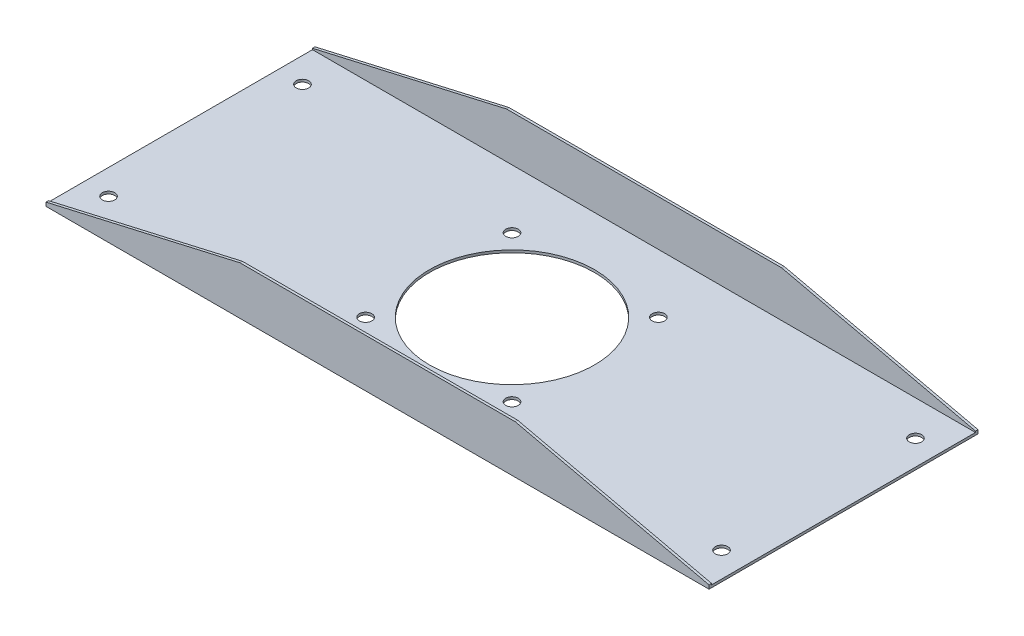
ISO-10303-21;
HEADER;
FILE_DESCRIPTION(('STEP AP214'),'2;1');
FILE_NAME('part.step','',(''),(''),'','','');
FILE_SCHEMA(('AUTOMOTIVE_DESIGN { 1 0 10303 214 1 1 1 1 }'));
ENDSEC;
DATA;
#1=APPLICATION_CONTEXT('core data for automotive mechanical design processes');
#2=APPLICATION_PROTOCOL_DEFINITION('international standard','automotive_design',2000,#1);
#3=PRODUCT_CONTEXT('',#1,'mechanical');
#4=PRODUCT('Part','Part','',(#3));
#5=PRODUCT_RELATED_PRODUCT_CATEGORY('part','',(#4));
#6=PRODUCT_DEFINITION_FORMATION('','',#4);
#7=PRODUCT_DEFINITION_CONTEXT('part definition',#1,'design');
#8=PRODUCT_DEFINITION('design','',#6,#7);
#9=PRODUCT_DEFINITION_SHAPE('','',#8);
#10=(LENGTH_UNIT() NAMED_UNIT(*) SI_UNIT(.MILLI.,.METRE.));
#11=(NAMED_UNIT(*) PLANE_ANGLE_UNIT() SI_UNIT($,.RADIAN.));
#12=(NAMED_UNIT(*) SI_UNIT($,.STERADIAN.) SOLID_ANGLE_UNIT());
#13=UNCERTAINTY_MEASURE_WITH_UNIT(LENGTH_MEASURE(1.E-05),#10,'distance_accuracy_value','');
#14=(GEOMETRIC_REPRESENTATION_CONTEXT(3) GLOBAL_UNCERTAINTY_ASSIGNED_CONTEXT((#13)) GLOBAL_UNIT_ASSIGNED_CONTEXT((#10,
#11,#12)) REPRESENTATION_CONTEXT('',''));
#15=CARTESIAN_POINT('',(0.,0.,0.));
#16=DIRECTION('',(0.,0.,1.));
#17=DIRECTION('',(1.,0.,0.));
#18=AXIS2_PLACEMENT_3D('',#15,#16,#17);
#19=CARTESIAN_POINT('',(530.,0.,103.));
#20=DIRECTION('',(0.,0.,1.));
#21=DIRECTION('',(1.,0.,0.));
#22=AXIS2_PLACEMENT_3D('',#19,#20,#21);
#23=PLANE('',#22);
#24=DIRECTION('',(-0.974760837002834,0.223251675571617,0.));
#25=VECTOR('',#24,1.);
#26=CARTESIAN_POINT('',(530.652850970427,2.85047606806343,103.));
#27=LINE('',#26,#25);
#28=CARTESIAN_POINT('',(530.,3.00000000000004,103.));
#29=VERTEX_POINT('',#28);
#30=CARTESIAN_POINT('',(375.,38.5,103.));
#31=VERTEX_POINT('',#30);
#32=EDGE_CURVE('E222',#29,#31,#27,.T.);
#33=ORIENTED_EDGE('',*,*,#32,.F.);
#34=DIRECTION('',(0.,1.,0.));
#35=VECTOR('',#34,1.);
#36=CARTESIAN_POINT('',(530.,0.,103.));
#37=LINE('',#36,#35);
#38=CARTESIAN_POINT('',(530.,2.,103.));
#39=VERTEX_POINT('',#38);
#40=EDGE_CURVE('E184',#39,#29,#37,.T.);
#41=ORIENTED_EDGE('',*,*,#40,.F.);
#42=DIRECTION('',(-1.,0.,0.));
#43=VECTOR('',#42,1.);
#44=CARTESIAN_POINT('',(530.,2.,103.));
#45=LINE('',#44,#43);
#46=CARTESIAN_POINT('',(0.,2.,103.));
#47=VERTEX_POINT('',#46);
#48=EDGE_CURVE('E185',#39,#47,#45,.T.);
#49=ORIENTED_EDGE('',*,*,#48,.T.);
#50=DIRECTION('',(0.,1.,0.));
#51=VECTOR('',#50,1.);
#52=CARTESIAN_POINT('',(0.,0.,103.));
#53=LINE('',#52,#51);
#54=CARTESIAN_POINT('',(0.,3.00000000000003,103.));
#55=VERTEX_POINT('',#54);
#56=EDGE_CURVE('E220',#47,#55,#53,.T.);
#57=ORIENTED_EDGE('',*,*,#56,.T.);
#58=DIRECTION('',(-0.974760837002834,-0.223251675571617,0.));
#59=VECTOR('',#58,1.);
#60=CARTESIAN_POINT('',(502.931254387439,118.187480843575,103.));
#61=LINE('',#60,#59);
#62=CARTESIAN_POINT('',(155.,38.5,103.));
#63=VERTEX_POINT('',#62);
#64=EDGE_CURVE('E257',#63,#55,#61,.T.);
#65=ORIENTED_EDGE('',*,*,#64,.F.);
#66=DIRECTION('',(-1.,0.,0.));
#67=VECTOR('',#66,1.);
#68=CARTESIAN_POINT('',(530.,38.5,103.));
#69=LINE('',#68,#67);
#70=EDGE_CURVE('E143',#31,#63,#69,.T.);
#71=ORIENTED_EDGE('',*,*,#70,.F.);
#72=EDGE_LOOP('',(#33,#41,#49,#57,#65,#71));
#73=FACE_BOUND('',#72,.T.);
#74=ADVANCED_FACE('F37',(#73),#23,.F.);
#75=CARTESIAN_POINT('',(530.,38.5,105.));
#76=DIRECTION('',(0.,1.,0.));
#77=DIRECTION('',(0.,0.,1.));
#78=AXIS2_PLACEMENT_3D('',#75,#76,#77);
#79=PLANE('',#78);
#80=DIRECTION('',(-1.,0.,0.));
#81=VECTOR('',#80,1.);
#82=CARTESIAN_POINT('',(530.,38.5,105.));
#83=LINE('',#82,#81);
#84=CARTESIAN_POINT('',(375.,38.5,105.));
#85=VERTEX_POINT('',#84);
#86=CARTESIAN_POINT('',(155.,38.5,105.));
#87=VERTEX_POINT('',#86);
#88=EDGE_CURVE('E141',#85,#87,#83,.T.);
#89=ORIENTED_EDGE('',*,*,#88,.F.);
#90=DIRECTION('',(0.,0.,-1.));
#91=VECTOR('',#90,1.);
#92=CARTESIAN_POINT('',(375.,38.5,105.));
#93=LINE('',#92,#91);
#94=EDGE_CURVE('E262',#85,#31,#93,.T.);
#95=ORIENTED_EDGE('',*,*,#94,.T.);
#96=ORIENTED_EDGE('',*,*,#70,.T.);
#97=DIRECTION('',(0.,0.,-1.));
#98=VECTOR('',#97,1.);
#99=CARTESIAN_POINT('',(155.,38.5,105.));
#100=LINE('',#99,#98);
#101=EDGE_CURVE('E126',#87,#63,#100,.T.);
#102=ORIENTED_EDGE('',*,*,#101,.F.);
#103=EDGE_LOOP('',(#89,#95,#96,#102));
#104=FACE_BOUND('',#103,.T.);
#105=ADVANCED_FACE('F139',(#104),#79,.T.);
#106=CARTESIAN_POINT('',(530.,0.,105.));
#107=DIRECTION('',(0.,0.,1.));
#108=DIRECTION('',(1.,0.,0.));
#109=AXIS2_PLACEMENT_3D('',#106,#107,#108);
#110=PLANE('',#109);
#111=DIRECTION('',(0.,1.,0.));
#112=VECTOR('',#111,1.);
#113=CARTESIAN_POINT('',(530.,0.,105.));
#114=LINE('',#113,#112);
#115=CARTESIAN_POINT('',(530.,0.,105.));
#116=VERTEX_POINT('',#115);
#117=CARTESIAN_POINT('',(530.,3.00000000000004,105.));
#118=VERTEX_POINT('',#117);
#119=EDGE_CURVE('E215',#116,#118,#114,.T.);
#120=ORIENTED_EDGE('',*,*,#119,.T.);
#121=DIRECTION('',(0.974760837002834,-0.223251675571617,0.));
#122=VECTOR('',#121,1.);
#123=CARTESIAN_POINT('',(530.,3.00000000000004,105.));
#124=LINE('',#123,#122);
#125=EDGE_CURVE('E58',#85,#118,#124,.T.);
#126=ORIENTED_EDGE('',*,*,#125,.F.);
#127=ORIENTED_EDGE('',*,*,#88,.T.);
#128=DIRECTION('',(0.974760837002834,0.223251675571617,0.));
#129=VECTOR('',#128,1.);
#130=CARTESIAN_POINT('',(155.,38.5,105.));
#131=LINE('',#130,#129);
#132=CARTESIAN_POINT('',(0.,3.00000000000004,105.));
#133=VERTEX_POINT('',#132);
#134=EDGE_CURVE('E123',#133,#87,#131,.T.);
#135=ORIENTED_EDGE('',*,*,#134,.F.);
#136=DIRECTION('',(0.,1.,0.));
#137=VECTOR('',#136,1.);
#138=CARTESIAN_POINT('',(0.,0.,105.));
#139=LINE('',#138,#137);
#140=CARTESIAN_POINT('',(0.,0.,105.));
#141=VERTEX_POINT('',#140);
#142=EDGE_CURVE('E179',#141,#133,#139,.T.);
#143=ORIENTED_EDGE('',*,*,#142,.F.);
#144=DIRECTION('',(-1.,0.,0.));
#145=VECTOR('',#144,1.);
#146=CARTESIAN_POINT('',(530.,0.,105.));
#147=LINE('',#146,#145);
#148=EDGE_CURVE('E149',#116,#141,#147,.T.);
#149=ORIENTED_EDGE('',*,*,#148,.F.);
#150=EDGE_LOOP('',(#120,#126,#127,#135,#143,#149));
#151=FACE_BOUND('',#150,.T.);
#152=ADVANCED_FACE('F148',(#151),#110,.T.);
#153=CARTESIAN_POINT('',(530.,0.,-110.));
#154=DIRECTION('',(0.,0.,-1.));
#155=DIRECTION('',(0.,1.,0.));
#156=AXIS2_PLACEMENT_3D('',#153,#154,#155);
#157=PLANE('',#156);
#158=DIRECTION('',(-1.,0.,0.));
#159=VECTOR('',#158,1.);
#160=CARTESIAN_POINT('',(530.,38.5,-110.));
#161=LINE('',#160,#159);
#162=CARTESIAN_POINT('',(375.,38.5,-110.));
#163=VERTEX_POINT('',#162);
#164=CARTESIAN_POINT('',(155.,38.5,-110.));
#165=VERTEX_POINT('',#164);
#166=EDGE_CURVE('E195',#163,#165,#161,.T.);
#167=ORIENTED_EDGE('',*,*,#166,.F.);
#168=DIRECTION('',(0.974760837002834,-0.223251675571617,0.));
#169=VECTOR('',#168,1.);
#170=CARTESIAN_POINT('',(530.,3.00000000000004,-110.));
#171=LINE('',#170,#169);
#172=CARTESIAN_POINT('',(530.,3.00000000000004,-110.));
#173=VERTEX_POINT('',#172);
#174=EDGE_CURVE('E134',#163,#173,#171,.T.);
#175=ORIENTED_EDGE('',*,*,#174,.T.);
#176=DIRECTION('',(0.,-1.,0.));
#177=VECTOR('',#176,1.);
#178=CARTESIAN_POINT('',(530.,0.,-110.));
#179=LINE('',#178,#177);
#180=CARTESIAN_POINT('',(530.,0.,-110.));
#181=VERTEX_POINT('',#180);
#182=EDGE_CURVE('E203',#173,#181,#179,.T.);
#183=ORIENTED_EDGE('',*,*,#182,.T.);
#184=DIRECTION('',(-1.,0.,0.));
#185=VECTOR('',#184,1.);
#186=CARTESIAN_POINT('',(530.,0.,-110.));
#187=LINE('',#186,#185);
#188=CARTESIAN_POINT('',(0.,0.,-110.));
#189=VERTEX_POINT('',#188);
#190=EDGE_CURVE('E152',#181,#189,#187,.T.);
#191=ORIENTED_EDGE('',*,*,#190,.T.);
#192=DIRECTION('',(0.,-1.,0.));
#193=VECTOR('',#192,1.);
#194=CARTESIAN_POINT('',(0.,0.,-110.));
#195=LINE('',#194,#193);
#196=CARTESIAN_POINT('',(0.,3.00000000000003,-110.));
#197=VERTEX_POINT('',#196);
#198=EDGE_CURVE('E161',#197,#189,#195,.T.);
#199=ORIENTED_EDGE('',*,*,#198,.F.);
#200=DIRECTION('',(0.974760837002834,0.223251675571617,0.));
#201=VECTOR('',#200,1.);
#202=CARTESIAN_POINT('',(155.,38.5,-110.));
#203=LINE('',#202,#201);
#204=EDGE_CURVE('E171',#197,#165,#203,.T.);
#205=ORIENTED_EDGE('',*,*,#204,.T.);
#206=EDGE_LOOP('',(#167,#175,#183,#191,#199,#205));
#207=FACE_BOUND('',#206,.T.);
#208=ADVANCED_FACE('F170',(#207),#157,.T.);
#209=CARTESIAN_POINT('',(530.,38.5,-108.));
#210=DIRECTION('',(0.,1.,0.));
#211=DIRECTION('',(0.,0.,1.));
#212=AXIS2_PLACEMENT_3D('',#209,#210,#211);
#213=PLANE('',#212);
#214=DIRECTION('',(-1.,0.,0.));
#215=VECTOR('',#214,1.);
#216=CARTESIAN_POINT('',(530.,38.5,-108.));
#217=LINE('',#216,#215);
#218=CARTESIAN_POINT('',(375.,38.5,-108.));
#219=VERTEX_POINT('',#218);
#220=CARTESIAN_POINT('',(155.,38.5,-108.));
#221=VERTEX_POINT('',#220);
#222=EDGE_CURVE('E192',#219,#221,#217,.T.);
#223=ORIENTED_EDGE('',*,*,#222,.F.);
#224=EDGE_CURVE('E144',#219,#163,#93,.T.);
#225=ORIENTED_EDGE('',*,*,#224,.T.);
#226=ORIENTED_EDGE('',*,*,#166,.T.);
#227=EDGE_CURVE('E145',#221,#165,#100,.T.);
#228=ORIENTED_EDGE('',*,*,#227,.F.);
#229=EDGE_LOOP('',(#223,#225,#226,#228));
#230=FACE_BOUND('',#229,.T.);
#231=ADVANCED_FACE('F200',(#230),#213,.T.);
#232=CARTESIAN_POINT('',(530.,0.,-108.));
#233=DIRECTION('',(0.,0.,-1.));
#234=DIRECTION('',(0.,1.,0.));
#235=AXIS2_PLACEMENT_3D('',#232,#233,#234);
#236=PLANE('',#235);
#237=DIRECTION('',(0.974760837002834,-0.223251675571617,0.));
#238=VECTOR('',#237,1.);
#239=CARTESIAN_POINT('',(530.652850970427,2.85047606806343,-108.));
#240=LINE('',#239,#238);
#241=CARTESIAN_POINT('',(530.,3.00000000000004,-108.));
#242=VERTEX_POINT('',#241);
#243=EDGE_CURVE('E50',#219,#242,#240,.T.);
#244=ORIENTED_EDGE('',*,*,#243,.F.);
#245=ORIENTED_EDGE('',*,*,#222,.T.);
#246=DIRECTION('',(0.974760837002834,0.223251675571617,0.));
#247=VECTOR('',#246,1.);
#248=CARTESIAN_POINT('',(502.931254387439,118.187480843575,-108.));
#249=LINE('',#248,#247);
#250=CARTESIAN_POINT('',(0.,3.00000000000004,-108.));
#251=VERTEX_POINT('',#250);
#252=EDGE_CURVE('E259',#251,#221,#249,.T.);
#253=ORIENTED_EDGE('',*,*,#252,.F.);
#254=DIRECTION('',(0.,-1.,0.));
#255=VECTOR('',#254,1.);
#256=CARTESIAN_POINT('',(0.,0.,-108.));
#257=LINE('',#256,#255);
#258=CARTESIAN_POINT('',(0.,2.,-108.));
#259=VERTEX_POINT('',#258);
#260=EDGE_CURVE('E164',#251,#259,#257,.T.);
#261=ORIENTED_EDGE('',*,*,#260,.T.);
#262=DIRECTION('',(-1.,0.,0.));
#263=VECTOR('',#262,1.);
#264=CARTESIAN_POINT('',(530.,2.,-108.));
#265=LINE('',#264,#263);
#266=CARTESIAN_POINT('',(530.,2.,-108.));
#267=VERTEX_POINT('',#266);
#268=EDGE_CURVE('E188',#267,#259,#265,.T.);
#269=ORIENTED_EDGE('',*,*,#268,.F.);
#270=DIRECTION('',(0.,-1.,0.));
#271=VECTOR('',#270,1.);
#272=CARTESIAN_POINT('',(530.,0.,-108.));
#273=LINE('',#272,#271);
#274=EDGE_CURVE('E212',#242,#267,#273,.T.);
#275=ORIENTED_EDGE('',*,*,#274,.F.);
#276=EDGE_LOOP('',(#244,#245,#253,#261,#269,#275));
#277=FACE_BOUND('',#276,.T.);
#278=ADVANCED_FACE('F346',(#277),#236,.F.);
#279=CARTESIAN_POINT('',(530.,0.,0.));
#280=DIRECTION('',(-1.,0.,0.));
#281=DIRECTION('',(0.,0.,1.));
#282=AXIS2_PLACEMENT_3D('',#279,#280,#281);
#283=PLANE('',#282);
#284=DIRECTION('',(0.,0.,-1.));
#285=VECTOR('',#284,1.);
#286=CARTESIAN_POINT('',(530.,3.00000000000004,105.));
#287=LINE('',#286,#285);
#288=EDGE_CURVE('E226',#118,#29,#287,.T.);
#289=ORIENTED_EDGE('',*,*,#288,.F.);
#290=ORIENTED_EDGE('',*,*,#119,.F.);
#291=DIRECTION('',(0.,0.,1.));
#292=VECTOR('',#291,1.);
#293=CARTESIAN_POINT('',(530.,0.,105.));
#294=LINE('',#293,#292);
#295=EDGE_CURVE('E211',#181,#116,#294,.T.);
#296=ORIENTED_EDGE('',*,*,#295,.F.);
#297=ORIENTED_EDGE('',*,*,#182,.F.);
#298=DIRECTION('',(0.,0.,-1.));
#299=VECTOR('',#298,1.);
#300=CARTESIAN_POINT('',(530.,3.00000000000004,0.));
#301=LINE('',#300,#299);
#302=EDGE_CURVE('E12',#242,#173,#301,.T.);
#303=ORIENTED_EDGE('',*,*,#302,.F.);
#304=ORIENTED_EDGE('',*,*,#274,.T.);
#305=DIRECTION('',(0.,0.,-1.));
#306=VECTOR('',#305,1.);
#307=CARTESIAN_POINT('',(530.,2.,105.));
#308=LINE('',#307,#306);
#309=EDGE_CURVE('E189',#267,#39,#308,.F.);
#310=ORIENTED_EDGE('',*,*,#309,.T.);
#311=ORIENTED_EDGE('',*,*,#40,.T.);
#312=EDGE_LOOP('',(#289,#290,#296,#297,#303,#304,#310,#311));
#313=FACE_BOUND('',#312,.T.);
#314=ADVANCED_FACE('F207',(#313),#283,.F.);
#315=CARTESIAN_POINT('',(0.,0.,0.));
#316=DIRECTION('',(-1.,0.,0.));
#317=DIRECTION('',(0.,0.,1.));
#318=AXIS2_PLACEMENT_3D('',#315,#316,#317);
#319=PLANE('',#318);
#320=ORIENTED_EDGE('',*,*,#142,.T.);
#321=DIRECTION('',(0.,0.,-1.));
#322=VECTOR('',#321,1.);
#323=CARTESIAN_POINT('',(0.,3.00000000000004,105.));
#324=LINE('',#323,#322);
#325=EDGE_CURVE('E129',#133,#55,#324,.T.);
#326=ORIENTED_EDGE('',*,*,#325,.T.);
#327=ORIENTED_EDGE('',*,*,#56,.F.);
#328=DIRECTION('',(0.,0.,-1.));
#329=VECTOR('',#328,1.);
#330=CARTESIAN_POINT('',(0.,2.,105.));
#331=LINE('',#330,#329);
#332=EDGE_CURVE('E177',#259,#47,#331,.F.);
#333=ORIENTED_EDGE('',*,*,#332,.F.);
#334=ORIENTED_EDGE('',*,*,#260,.F.);
#335=DIRECTION('',(0.,0.,-1.));
#336=VECTOR('',#335,1.);
#337=CARTESIAN_POINT('',(0.,3.00000000000003,0.));
#338=LINE('',#337,#336);
#339=EDGE_CURVE('E44',#251,#197,#338,.T.);
#340=ORIENTED_EDGE('',*,*,#339,.T.);
#341=ORIENTED_EDGE('',*,*,#198,.T.);
#342=DIRECTION('',(0.,0.,1.));
#343=VECTOR('',#342,1.);
#344=CARTESIAN_POINT('',(0.,0.,105.));
#345=LINE('',#344,#343);
#346=EDGE_CURVE('E175',#189,#141,#345,.T.);
#347=ORIENTED_EDGE('',*,*,#346,.T.);
#348=EDGE_LOOP('',(#320,#326,#327,#333,#334,#340,#341,#347));
#349=FACE_BOUND('',#348,.T.);
#350=ADVANCED_FACE('F159',(#349),#319,.T.);
#351=CARTESIAN_POINT('',(530.,0.,105.));
#352=DIRECTION('',(0.,-1.,0.));
#353=DIRECTION('',(0.,0.,-1.));
#354=AXIS2_PLACEMENT_3D('',#351,#352,#353);
#355=PLANE('',#354);
#356=CARTESIAN_POINT('',(206.486027125825,0.,-61.0139728741746));
#357=DIRECTION('',(0.,1.,0.));
#358=DIRECTION('',(0.,0.,1.));
#359=AXIS2_PLACEMENT_3D('',#356,#357,#358);
#360=CIRCLE('',#359,4.99999999999998);
#361=CARTESIAN_POINT('',(206.486027125825,0.,-56.0139728741746));
#362=VERTEX_POINT('',#361);
#363=EDGE_CURVE('E313',#362,#362,#360,.T.);
#364=ORIENTED_EDGE('',*,*,#363,.T.);
#365=EDGE_LOOP('',(#364));
#366=FACE_BOUND('',#365,.T.);
#367=CARTESIAN_POINT('',(206.486027125826,0.,56.0139728741772));
#368=DIRECTION('',(0.,1.,0.));
#369=DIRECTION('',(0.,0.,1.));
#370=AXIS2_PLACEMENT_3D('',#367,#368,#369);
#371=CIRCLE('',#370,4.99999999999998);
#372=CARTESIAN_POINT('',(206.486027125826,0.,61.0139728741772));
#373=VERTEX_POINT('',#372);
#374=EDGE_CURVE('E307',#373,#373,#371,.T.);
#375=ORIENTED_EDGE('',*,*,#374,.T.);
#376=EDGE_LOOP('',(#375));
#377=FACE_BOUND('',#376,.T.);
#378=CARTESIAN_POINT('',(323.513972874177,0.,56.013972874176));
#379=DIRECTION('',(0.,1.,0.));
#380=DIRECTION('',(0.,0.,1.));
#381=AXIS2_PLACEMENT_3D('',#378,#379,#380);
#382=CIRCLE('',#381,4.99999999999998);
#383=CARTESIAN_POINT('',(323.513972874177,0.,61.013972874176));
#384=VERTEX_POINT('',#383);
#385=EDGE_CURVE('E301',#384,#384,#382,.T.);
#386=ORIENTED_EDGE('',*,*,#385,.T.);
#387=EDGE_LOOP('',(#386));
#388=FACE_BOUND('',#387,.T.);
#389=CARTESIAN_POINT('',(323.513972874176,0.,-61.0139728741759));
#390=DIRECTION('',(0.,1.,0.));
#391=DIRECTION('',(0.,0.,1.));
#392=AXIS2_PLACEMENT_3D('',#389,#390,#391);
#393=CIRCLE('',#392,4.99999999999999);
#394=CARTESIAN_POINT('',(323.513972874176,0.,-56.0139728741759));
#395=VERTEX_POINT('',#394);
#396=EDGE_CURVE('E295',#395,#395,#393,.T.);
#397=ORIENTED_EDGE('',*,*,#396,.T.);
#398=EDGE_LOOP('',(#397));
#399=FACE_BOUND('',#398,.T.);
#400=CARTESIAN_POINT('',(265.,0.,-2.49999999999995));
#401=DIRECTION('',(0.,1.,0.));
#402=DIRECTION('',(0.,0.,1.));
#403=AXIS2_PLACEMENT_3D('',#400,#401,#402);
#404=CIRCLE('',#403,66.);
#405=CARTESIAN_POINT('',(265.,0.,63.5));
#406=VERTEX_POINT('',#405);
#407=EDGE_CURVE('E289',#406,#406,#404,.T.);
#408=ORIENTED_EDGE('',*,*,#407,.T.);
#409=EDGE_LOOP('',(#408));
#410=FACE_BOUND('',#409,.T.);
#411=CARTESIAN_POINT('',(510.,0.,75.));
#412=DIRECTION('',(0.,1.,0.));
#413=DIRECTION('',(0.,0.,1.));
#414=AXIS2_PLACEMENT_3D('',#411,#412,#413);
#415=CIRCLE('',#414,5.00000000000005);
#416=CARTESIAN_POINT('',(510.,0.,80.0000000000001));
#417=VERTEX_POINT('',#416);
#418=EDGE_CURVE('E283',#417,#417,#415,.T.);
#419=ORIENTED_EDGE('',*,*,#418,.T.);
#420=EDGE_LOOP('',(#419));
#421=FACE_BOUND('',#420,.T.);
#422=CARTESIAN_POINT('',(510.,0.,-80.));
#423=DIRECTION('',(0.,1.,0.));
#424=DIRECTION('',(0.,0.,1.));
#425=AXIS2_PLACEMENT_3D('',#422,#423,#424);
#426=CIRCLE('',#425,5.00000000000005);
#427=CARTESIAN_POINT('',(510.,0.,-74.9999999999999));
#428=VERTEX_POINT('',#427);
#429=EDGE_CURVE('E277',#428,#428,#426,.T.);
#430=ORIENTED_EDGE('',*,*,#429,.T.);
#431=EDGE_LOOP('',(#430));
#432=FACE_BOUND('',#431,.T.);
#433=CARTESIAN_POINT('',(20.,0.,75.));
#434=DIRECTION('',(0.,1.,0.));
#435=DIRECTION('',(0.,0.,1.));
#436=AXIS2_PLACEMENT_3D('',#433,#434,#435);
#437=CIRCLE('',#436,5.);
#438=CARTESIAN_POINT('',(20.,0.,80.));
#439=VERTEX_POINT('',#438);
#440=EDGE_CURVE('E271',#439,#439,#437,.T.);
#441=ORIENTED_EDGE('',*,*,#440,.T.);
#442=EDGE_LOOP('',(#441));
#443=FACE_BOUND('',#442,.T.);
#444=CARTESIAN_POINT('',(20.,0.,-80.));
#445=DIRECTION('',(0.,1.,0.));
#446=DIRECTION('',(0.,0.,1.));
#447=AXIS2_PLACEMENT_3D('',#444,#445,#446);
#448=CIRCLE('',#447,5.);
#449=CARTESIAN_POINT('',(20.,0.,-75.));
#450=VERTEX_POINT('',#449);
#451=EDGE_CURVE('E266',#450,#450,#448,.T.);
#452=ORIENTED_EDGE('',*,*,#451,.T.);
#453=EDGE_LOOP('',(#452));
#454=FACE_BOUND('',#453,.T.);
#455=ORIENTED_EDGE('',*,*,#346,.F.);
#456=ORIENTED_EDGE('',*,*,#190,.F.);
#457=ORIENTED_EDGE('',*,*,#295,.T.);
#458=ORIENTED_EDGE('',*,*,#148,.T.);
#459=EDGE_LOOP('',(#455,#456,#457,#458));
#460=FACE_BOUND('',#459,.T.);
#461=ADVANCED_FACE('F227',(#366,#377,#388,#399,#410,#421,#432,#443,#454,#460),#355,.T.);
#462=CARTESIAN_POINT('',(530.,2.,105.));
#463=DIRECTION('',(0.,-1.,0.));
#464=DIRECTION('',(0.,0.,-1.));
#465=AXIS2_PLACEMENT_3D('',#462,#463,#464);
#466=PLANE('',#465);
#467=CARTESIAN_POINT('',(206.486027125825,2.,-61.0139728741746));
#468=DIRECTION('',(0.,1.,0.));
#469=DIRECTION('',(0.,0.,1.));
#470=AXIS2_PLACEMENT_3D('',#467,#468,#469);
#471=CIRCLE('',#470,4.99999999999998);
#472=CARTESIAN_POINT('',(206.486027125825,2.,-56.0139728741746));
#473=VERTEX_POINT('',#472);
#474=EDGE_CURVE('E316',#473,#473,#471,.T.);
#475=ORIENTED_EDGE('',*,*,#474,.F.);
#476=EDGE_LOOP('',(#475));
#477=FACE_BOUND('',#476,.T.);
#478=CARTESIAN_POINT('',(206.486027125826,2.,56.0139728741772));
#479=DIRECTION('',(0.,1.,0.));
#480=DIRECTION('',(0.,0.,1.));
#481=AXIS2_PLACEMENT_3D('',#478,#479,#480);
#482=CIRCLE('',#481,4.99999999999998);
#483=CARTESIAN_POINT('',(206.486027125826,2.,61.0139728741772));
#484=VERTEX_POINT('',#483);
#485=EDGE_CURVE('E310',#484,#484,#482,.T.);
#486=ORIENTED_EDGE('',*,*,#485,.F.);
#487=EDGE_LOOP('',(#486));
#488=FACE_BOUND('',#487,.T.);
#489=CARTESIAN_POINT('',(323.513972874177,2.,56.013972874176));
#490=DIRECTION('',(0.,1.,0.));
#491=DIRECTION('',(0.,0.,1.));
#492=AXIS2_PLACEMENT_3D('',#489,#490,#491);
#493=CIRCLE('',#492,4.99999999999998);
#494=CARTESIAN_POINT('',(323.513972874177,2.,61.013972874176));
#495=VERTEX_POINT('',#494);
#496=EDGE_CURVE('E304',#495,#495,#493,.T.);
#497=ORIENTED_EDGE('',*,*,#496,.F.);
#498=EDGE_LOOP('',(#497));
#499=FACE_BOUND('',#498,.T.);
#500=CARTESIAN_POINT('',(323.513972874176,2.,-61.0139728741759));
#501=DIRECTION('',(0.,1.,0.));
#502=DIRECTION('',(0.,0.,1.));
#503=AXIS2_PLACEMENT_3D('',#500,#501,#502);
#504=CIRCLE('',#503,4.99999999999999);
#505=CARTESIAN_POINT('',(323.513972874176,2.,-56.0139728741759));
#506=VERTEX_POINT('',#505);
#507=EDGE_CURVE('E298',#506,#506,#504,.T.);
#508=ORIENTED_EDGE('',*,*,#507,.F.);
#509=EDGE_LOOP('',(#508));
#510=FACE_BOUND('',#509,.T.);
#511=CARTESIAN_POINT('',(265.,2.,-2.49999999999995));
#512=DIRECTION('',(0.,1.,0.));
#513=DIRECTION('',(0.,0.,1.));
#514=AXIS2_PLACEMENT_3D('',#511,#512,#513);
#515=CIRCLE('',#514,66.);
#516=CARTESIAN_POINT('',(265.,2.,63.5));
#517=VERTEX_POINT('',#516);
#518=EDGE_CURVE('E292',#517,#517,#515,.T.);
#519=ORIENTED_EDGE('',*,*,#518,.F.);
#520=EDGE_LOOP('',(#519));
#521=FACE_BOUND('',#520,.T.);
#522=CARTESIAN_POINT('',(510.,2.,75.));
#523=DIRECTION('',(0.,1.,0.));
#524=DIRECTION('',(0.,0.,1.));
#525=AXIS2_PLACEMENT_3D('',#522,#523,#524);
#526=CIRCLE('',#525,5.00000000000005);
#527=CARTESIAN_POINT('',(510.,2.,80.0000000000001));
#528=VERTEX_POINT('',#527);
#529=EDGE_CURVE('E286',#528,#528,#526,.T.);
#530=ORIENTED_EDGE('',*,*,#529,.F.);
#531=EDGE_LOOP('',(#530));
#532=FACE_BOUND('',#531,.T.);
#533=CARTESIAN_POINT('',(510.,2.,-80.));
#534=DIRECTION('',(0.,1.,0.));
#535=DIRECTION('',(0.,0.,1.));
#536=AXIS2_PLACEMENT_3D('',#533,#534,#535);
#537=CIRCLE('',#536,5.00000000000005);
#538=CARTESIAN_POINT('',(510.,2.,-74.9999999999999));
#539=VERTEX_POINT('',#538);
#540=EDGE_CURVE('E280',#539,#539,#537,.T.);
#541=ORIENTED_EDGE('',*,*,#540,.F.);
#542=EDGE_LOOP('',(#541));
#543=FACE_BOUND('',#542,.T.);
#544=CARTESIAN_POINT('',(20.,2.,75.));
#545=DIRECTION('',(0.,1.,0.));
#546=DIRECTION('',(0.,0.,1.));
#547=AXIS2_PLACEMENT_3D('',#544,#545,#546);
#548=CIRCLE('',#547,5.);
#549=CARTESIAN_POINT('',(20.,2.,80.));
#550=VERTEX_POINT('',#549);
#551=EDGE_CURVE('E274',#550,#550,#548,.T.);
#552=ORIENTED_EDGE('',*,*,#551,.F.);
#553=EDGE_LOOP('',(#552));
#554=FACE_BOUND('',#553,.T.);
#555=CARTESIAN_POINT('',(20.,2.,-80.));
#556=DIRECTION('',(0.,1.,0.));
#557=DIRECTION('',(0.,0.,1.));
#558=AXIS2_PLACEMENT_3D('',#555,#556,#557);
#559=CIRCLE('',#558,5.);
#560=CARTESIAN_POINT('',(20.,2.,-75.));
#561=VERTEX_POINT('',#560);
#562=EDGE_CURVE('E268',#561,#561,#559,.T.);
#563=ORIENTED_EDGE('',*,*,#562,.F.);
#564=EDGE_LOOP('',(#563));
#565=FACE_BOUND('',#564,.T.);
#566=ORIENTED_EDGE('',*,*,#332,.T.);
#567=ORIENTED_EDGE('',*,*,#48,.F.);
#568=ORIENTED_EDGE('',*,*,#309,.F.);
#569=ORIENTED_EDGE('',*,*,#268,.T.);
#570=EDGE_LOOP('',(#566,#567,#568,#569));
#571=FACE_BOUND('',#570,.T.);
#572=ADVANCED_FACE('F229',(#477,#488,#499,#510,#521,#532,#543,#554,#565,#571),#466,.F.);
#573=CARTESIAN_POINT('',(155.,38.5,105.));
#574=DIRECTION('',(-0.223251675571617,0.974760837002834,0.));
#575=DIRECTION('',(-0.974760837002834,-0.223251675571617,0.));
#576=AXIS2_PLACEMENT_3D('',#573,#574,#575);
#577=PLANE('',#576);
#578=ORIENTED_EDGE('',*,*,#252,.T.);
#579=ORIENTED_EDGE('',*,*,#227,.T.);
#580=ORIENTED_EDGE('',*,*,#204,.F.);
#581=ORIENTED_EDGE('',*,*,#339,.F.);
#582=EDGE_LOOP('',(#578,#579,#580,#581));
#583=FACE_BOUND('',#582,.T.);
#584=ADVANCED_FACE('F236',(#583),#577,.T.);
#585=ORIENTED_EDGE('',*,*,#64,.T.);
#586=ORIENTED_EDGE('',*,*,#325,.F.);
#587=ORIENTED_EDGE('',*,*,#134,.T.);
#588=ORIENTED_EDGE('',*,*,#101,.T.);
#589=EDGE_LOOP('',(#585,#586,#587,#588));
#590=FACE_BOUND('',#589,.T.);
#591=ADVANCED_FACE('F125',(#590),#577,.T.);
#592=CARTESIAN_POINT('',(530.,3.00000000000004,105.));
#593=DIRECTION('',(0.223251675571617,0.974760837002834,0.));
#594=DIRECTION('',(-0.974760837002834,0.223251675571617,0.));
#595=AXIS2_PLACEMENT_3D('',#592,#593,#594);
#596=PLANE('',#595);
#597=ORIENTED_EDGE('',*,*,#243,.T.);
#598=ORIENTED_EDGE('',*,*,#302,.T.);
#599=ORIENTED_EDGE('',*,*,#174,.F.);
#600=ORIENTED_EDGE('',*,*,#224,.F.);
#601=EDGE_LOOP('',(#597,#598,#599,#600));
#602=FACE_BOUND('',#601,.T.);
#603=ADVANCED_FACE('F352',(#602),#596,.T.);
#604=ORIENTED_EDGE('',*,*,#32,.T.);
#605=ORIENTED_EDGE('',*,*,#94,.F.);
#606=ORIENTED_EDGE('',*,*,#125,.T.);
#607=ORIENTED_EDGE('',*,*,#288,.T.);
#608=EDGE_LOOP('',(#604,#605,#606,#607));
#609=FACE_BOUND('',#608,.T.);
#610=ADVANCED_FACE('F355',(#609),#596,.T.);
#611=CARTESIAN_POINT('',(20.,0.,-80.));
#612=DIRECTION('',(0.,1.,0.));
#613=DIRECTION('',(0.,0.,1.));
#614=AXIS2_PLACEMENT_3D('',#611,#612,#613);
#615=CYLINDRICAL_SURFACE('',#614,5.);
#616=ORIENTED_EDGE('',*,*,#451,.F.);
#617=EDGE_LOOP('',(#616));
#618=FACE_BOUND('',#617,.T.);
#619=ORIENTED_EDGE('',*,*,#562,.T.);
#620=EDGE_LOOP('',(#619));
#621=FACE_BOUND('',#620,.T.);
#622=ADVANCED_FACE('F402',(#618,#621),#615,.F.);
#623=CARTESIAN_POINT('',(20.,0.,75.));
#624=DIRECTION('',(0.,1.,0.));
#625=DIRECTION('',(0.,0.,1.));
#626=AXIS2_PLACEMENT_3D('',#623,#624,#625);
#627=CYLINDRICAL_SURFACE('',#626,5.);
#628=ORIENTED_EDGE('',*,*,#440,.F.);
#629=EDGE_LOOP('',(#628));
#630=FACE_BOUND('',#629,.T.);
#631=ORIENTED_EDGE('',*,*,#551,.T.);
#632=EDGE_LOOP('',(#631));
#633=FACE_BOUND('',#632,.T.);
#634=ADVANCED_FACE('F409',(#630,#633),#627,.F.);
#635=CARTESIAN_POINT('',(510.,0.,-80.));
#636=DIRECTION('',(0.,1.,0.));
#637=DIRECTION('',(0.,0.,1.));
#638=AXIS2_PLACEMENT_3D('',#635,#636,#637);
#639=CYLINDRICAL_SURFACE('',#638,5.00000000000005);
#640=ORIENTED_EDGE('',*,*,#429,.F.);
#641=EDGE_LOOP('',(#640));
#642=FACE_BOUND('',#641,.T.);
#643=ORIENTED_EDGE('',*,*,#540,.T.);
#644=EDGE_LOOP('',(#643));
#645=FACE_BOUND('',#644,.T.);
#646=ADVANCED_FACE('F418',(#642,#645),#639,.F.);
#647=CARTESIAN_POINT('',(510.,0.,75.));
#648=DIRECTION('',(0.,1.,0.));
#649=DIRECTION('',(0.,0.,1.));
#650=AXIS2_PLACEMENT_3D('',#647,#648,#649);
#651=CYLINDRICAL_SURFACE('',#650,5.00000000000005);
#652=ORIENTED_EDGE('',*,*,#418,.F.);
#653=EDGE_LOOP('',(#652));
#654=FACE_BOUND('',#653,.T.);
#655=ORIENTED_EDGE('',*,*,#529,.T.);
#656=EDGE_LOOP('',(#655));
#657=FACE_BOUND('',#656,.T.);
#658=ADVANCED_FACE('F427',(#654,#657),#651,.F.);
#659=CARTESIAN_POINT('',(265.,0.,-2.49999999999995));
#660=DIRECTION('',(0.,1.,0.));
#661=DIRECTION('',(0.,0.,1.));
#662=AXIS2_PLACEMENT_3D('',#659,#660,#661);
#663=CYLINDRICAL_SURFACE('',#662,66.);
#664=ORIENTED_EDGE('',*,*,#407,.F.);
#665=EDGE_LOOP('',(#664));
#666=FACE_BOUND('',#665,.T.);
#667=ORIENTED_EDGE('',*,*,#518,.T.);
#668=EDGE_LOOP('',(#667));
#669=FACE_BOUND('',#668,.T.);
#670=ADVANCED_FACE('F436',(#666,#669),#663,.F.);
#671=CARTESIAN_POINT('',(323.513972874176,0.,-61.0139728741759));
#672=DIRECTION('',(0.,1.,0.));
#673=DIRECTION('',(0.,0.,1.));
#674=AXIS2_PLACEMENT_3D('',#671,#672,#673);
#675=CYLINDRICAL_SURFACE('',#674,4.99999999999999);
#676=ORIENTED_EDGE('',*,*,#396,.F.);
#677=EDGE_LOOP('',(#676));
#678=FACE_BOUND('',#677,.T.);
#679=ORIENTED_EDGE('',*,*,#507,.T.);
#680=EDGE_LOOP('',(#679));
#681=FACE_BOUND('',#680,.T.);
#682=ADVANCED_FACE('F445',(#678,#681),#675,.F.);
#683=CARTESIAN_POINT('',(323.513972874177,0.,56.013972874176));
#684=DIRECTION('',(0.,1.,0.));
#685=DIRECTION('',(0.,0.,1.));
#686=AXIS2_PLACEMENT_3D('',#683,#684,#685);
#687=CYLINDRICAL_SURFACE('',#686,4.99999999999998);
#688=ORIENTED_EDGE('',*,*,#385,.F.);
#689=EDGE_LOOP('',(#688));
#690=FACE_BOUND('',#689,.T.);
#691=ORIENTED_EDGE('',*,*,#496,.T.);
#692=EDGE_LOOP('',(#691));
#693=FACE_BOUND('',#692,.T.);
#694=ADVANCED_FACE('F454',(#690,#693),#687,.F.);
#695=CARTESIAN_POINT('',(206.486027125826,0.,56.0139728741772));
#696=DIRECTION('',(0.,1.,0.));
#697=DIRECTION('',(0.,0.,1.));
#698=AXIS2_PLACEMENT_3D('',#695,#696,#697);
#699=CYLINDRICAL_SURFACE('',#698,4.99999999999998);
#700=ORIENTED_EDGE('',*,*,#374,.F.);
#701=EDGE_LOOP('',(#700));
#702=FACE_BOUND('',#701,.T.);
#703=ORIENTED_EDGE('',*,*,#485,.T.);
#704=EDGE_LOOP('',(#703));
#705=FACE_BOUND('',#704,.T.);
#706=ADVANCED_FACE('F324',(#702,#705),#699,.F.);
#707=CARTESIAN_POINT('',(206.486027125825,0.,-61.0139728741746));
#708=DIRECTION('',(0.,1.,0.));
#709=DIRECTION('',(0.,0.,1.));
#710=AXIS2_PLACEMENT_3D('',#707,#708,#709);
#711=CYLINDRICAL_SURFACE('',#710,4.99999999999998);
#712=ORIENTED_EDGE('',*,*,#363,.F.);
#713=EDGE_LOOP('',(#712));
#714=FACE_BOUND('',#713,.T.);
#715=ORIENTED_EDGE('',*,*,#474,.T.);
#716=EDGE_LOOP('',(#715));
#717=FACE_BOUND('',#716,.T.);
#718=ADVANCED_FACE('F321',(#714,#717),#711,.F.);
#719=CLOSED_SHELL('',(#74,#105,#152,#208,#231,#278,#314,#350,#461,#572,#584,#591,#603,#610,#622,
#634,#646,#658,#670,#682,#694,#706,#718));
#720=MANIFOLD_SOLID_BREP('B2',#719);
#721=ADVANCED_BREP_SHAPE_REPRESENTATION('',(#18,#720),#14);
#722=SHAPE_DEFINITION_REPRESENTATION(#9,#721);
ENDSEC;
END-ISO-10303-21;
